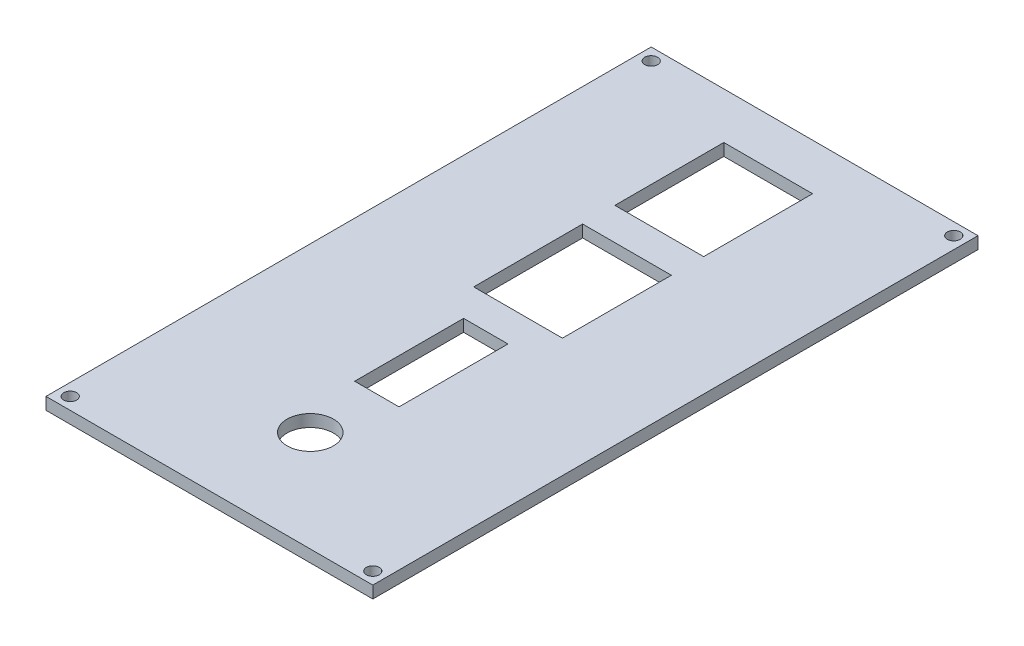
ISO-10303-21;
HEADER;
FILE_DESCRIPTION(('STEP AP214'),'2;1');
FILE_NAME('part.step','',(''),(''),'','','');
FILE_SCHEMA(('AUTOMOTIVE_DESIGN { 1 0 10303 214 1 1 1 1 }'));
ENDSEC;
DATA;
#1=APPLICATION_CONTEXT('core data for automotive mechanical design processes');
#2=APPLICATION_PROTOCOL_DEFINITION('international standard','automotive_design',2000,#1);
#3=PRODUCT_CONTEXT('',#1,'mechanical');
#4=PRODUCT('Part','Part','',(#3));
#5=PRODUCT_RELATED_PRODUCT_CATEGORY('part','',(#4));
#6=PRODUCT_DEFINITION_FORMATION('','',#4);
#7=PRODUCT_DEFINITION_CONTEXT('part definition',#1,'design');
#8=PRODUCT_DEFINITION('design','',#6,#7);
#9=PRODUCT_DEFINITION_SHAPE('','',#8);
#10=(LENGTH_UNIT() NAMED_UNIT(*) SI_UNIT(.MILLI.,.METRE.));
#11=(NAMED_UNIT(*) PLANE_ANGLE_UNIT() SI_UNIT($,.RADIAN.));
#12=(NAMED_UNIT(*) SI_UNIT($,.STERADIAN.) SOLID_ANGLE_UNIT());
#13=UNCERTAINTY_MEASURE_WITH_UNIT(LENGTH_MEASURE(1.E-05),#10,'distance_accuracy_value','');
#14=(GEOMETRIC_REPRESENTATION_CONTEXT(3) GLOBAL_UNCERTAINTY_ASSIGNED_CONTEXT((#13)) GLOBAL_UNIT_ASSIGNED_CONTEXT((#10,
#11,#12)) REPRESENTATION_CONTEXT('',''));
#15=CARTESIAN_POINT('',(0.,0.,0.));
#16=DIRECTION('',(0.,0.,1.));
#17=DIRECTION('',(1.,0.,0.));
#18=AXIS2_PLACEMENT_3D('',#15,#16,#17);
#19=CARTESIAN_POINT('',(0.,3.,0.));
#20=DIRECTION('',(1.,0.,0.));
#21=DIRECTION('',(0.,0.,-1.));
#22=AXIS2_PLACEMENT_3D('',#19,#20,#21);
#23=PLANE('',#22);
#24=DIRECTION('',(0.,0.,1.));
#25=VECTOR('',#24,1.);
#26=CARTESIAN_POINT('',(0.,0.,0.));
#27=LINE('',#26,#25);
#28=CARTESIAN_POINT('',(0.,0.,-150.));
#29=VERTEX_POINT('',#28);
#30=CARTESIAN_POINT('',(0.,0.,0.));
#31=VERTEX_POINT('',#30);
#32=EDGE_CURVE('E328',#29,#31,#27,.T.);
#33=ORIENTED_EDGE('',*,*,#32,.T.);
#34=DIRECTION('',(0.,-1.,0.));
#35=VECTOR('',#34,1.);
#36=CARTESIAN_POINT('',(0.,3.,0.));
#37=LINE('',#36,#35);
#38=CARTESIAN_POINT('',(0.,3.,0.));
#39=VERTEX_POINT('',#38);
#40=EDGE_CURVE('E11',#39,#31,#37,.T.);
#41=ORIENTED_EDGE('',*,*,#40,.F.);
#42=DIRECTION('',(0.,0.,1.));
#43=VECTOR('',#42,1.);
#44=CARTESIAN_POINT('',(0.,3.,0.));
#45=LINE('',#44,#43);
#46=CARTESIAN_POINT('',(0.,3.,-150.));
#47=VERTEX_POINT('',#46);
#48=EDGE_CURVE('E329',#47,#39,#45,.T.);
#49=ORIENTED_EDGE('',*,*,#48,.F.);
#50=DIRECTION('',(0.,-1.,0.));
#51=VECTOR('',#50,1.);
#52=CARTESIAN_POINT('',(0.,3.,-150.));
#53=LINE('',#52,#51);
#54=EDGE_CURVE('E343',#47,#29,#53,.T.);
#55=ORIENTED_EDGE('',*,*,#54,.T.);
#56=EDGE_LOOP('',(#33,#41,#49,#55));
#57=FACE_BOUND('',#56,.T.);
#58=ADVANCED_FACE('F38',(#57),#23,.F.);
#59=CARTESIAN_POINT('',(0.,3.,0.));
#60=DIRECTION('',(0.,0.,-1.));
#61=DIRECTION('',(-1.,0.,0.));
#62=AXIS2_PLACEMENT_3D('',#59,#60,#61);
#63=PLANE('',#62);
#64=DIRECTION('',(1.,0.,0.));
#65=VECTOR('',#64,1.);
#66=CARTESIAN_POINT('',(0.,0.,0.));
#67=LINE('',#66,#65);
#68=CARTESIAN_POINT('',(81.,0.,0.));
#69=VERTEX_POINT('',#68);
#70=EDGE_CURVE('E347',#31,#69,#67,.T.);
#71=ORIENTED_EDGE('',*,*,#70,.T.);
#72=DIRECTION('',(0.,-1.,0.));
#73=VECTOR('',#72,1.);
#74=CARTESIAN_POINT('',(81.,3.,0.));
#75=LINE('',#74,#73);
#76=CARTESIAN_POINT('',(81.,3.,0.));
#77=VERTEX_POINT('',#76);
#78=EDGE_CURVE('E46',#77,#69,#75,.T.);
#79=ORIENTED_EDGE('',*,*,#78,.F.);
#80=DIRECTION('',(1.,0.,0.));
#81=VECTOR('',#80,1.);
#82=CARTESIAN_POINT('',(0.,3.,0.));
#83=LINE('',#82,#81);
#84=EDGE_CURVE('E333',#39,#77,#83,.T.);
#85=ORIENTED_EDGE('',*,*,#84,.F.);
#86=ORIENTED_EDGE('',*,*,#40,.T.);
#87=EDGE_LOOP('',(#71,#79,#85,#86));
#88=FACE_BOUND('',#87,.T.);
#89=ADVANCED_FACE('F382',(#88),#63,.F.);
#90=CARTESIAN_POINT('',(81.,3.,0.));
#91=DIRECTION('',(-1.,0.,0.));
#92=DIRECTION('',(0.,0.,1.));
#93=AXIS2_PLACEMENT_3D('',#90,#91,#92);
#94=PLANE('',#93);
#95=DIRECTION('',(0.,0.,-1.));
#96=VECTOR('',#95,1.);
#97=CARTESIAN_POINT('',(81.,0.,0.));
#98=LINE('',#97,#96);
#99=CARTESIAN_POINT('',(81.,0.,-150.));
#100=VERTEX_POINT('',#99);
#101=EDGE_CURVE('E350',#69,#100,#98,.T.);
#102=ORIENTED_EDGE('',*,*,#101,.T.);
#103=DIRECTION('',(0.,-1.,0.));
#104=VECTOR('',#103,1.);
#105=CARTESIAN_POINT('',(81.,3.,-150.));
#106=LINE('',#105,#104);
#107=CARTESIAN_POINT('',(81.,3.,-150.));
#108=VERTEX_POINT('',#107);
#109=EDGE_CURVE('E358',#108,#100,#106,.T.);
#110=ORIENTED_EDGE('',*,*,#109,.F.);
#111=DIRECTION('',(0.,0.,-1.));
#112=VECTOR('',#111,1.);
#113=CARTESIAN_POINT('',(81.,3.,0.));
#114=LINE('',#113,#112);
#115=EDGE_CURVE('E337',#77,#108,#114,.T.);
#116=ORIENTED_EDGE('',*,*,#115,.F.);
#117=ORIENTED_EDGE('',*,*,#78,.T.);
#118=EDGE_LOOP('',(#102,#110,#116,#117));
#119=FACE_BOUND('',#118,.T.);
#120=ADVANCED_FACE('F367',(#119),#94,.F.);
#121=CARTESIAN_POINT('',(0.,3.,-150.));
#122=DIRECTION('',(0.,0.,1.));
#123=DIRECTION('',(1.,0.,0.));
#124=AXIS2_PLACEMENT_3D('',#121,#122,#123);
#125=PLANE('',#124);
#126=DIRECTION('',(-1.,0.,0.));
#127=VECTOR('',#126,1.);
#128=CARTESIAN_POINT('',(0.,0.,-150.));
#129=LINE('',#128,#127);
#130=EDGE_CURVE('E334',#100,#29,#129,.T.);
#131=ORIENTED_EDGE('',*,*,#130,.T.);
#132=ORIENTED_EDGE('',*,*,#54,.F.);
#133=DIRECTION('',(-1.,0.,0.));
#134=VECTOR('',#133,1.);
#135=CARTESIAN_POINT('',(0.,3.,-150.));
#136=LINE('',#135,#134);
#137=EDGE_CURVE('E340',#108,#47,#136,.T.);
#138=ORIENTED_EDGE('',*,*,#137,.F.);
#139=ORIENTED_EDGE('',*,*,#109,.T.);
#140=EDGE_LOOP('',(#131,#132,#138,#139));
#141=FACE_BOUND('',#140,.T.);
#142=ADVANCED_FACE('F375',(#141),#125,.F.);
#143=CARTESIAN_POINT('',(0.,3.,0.));
#144=DIRECTION('',(0.,-1.,0.));
#145=DIRECTION('',(0.,0.,-1.));
#146=AXIS2_PLACEMENT_3D('',#143,#144,#145);
#147=PLANE('',#146);
#148=DIRECTION('',(-1.,0.,0.));
#149=VECTOR('',#148,1.);
#150=CARTESIAN_POINT('',(29.5,3.,-138.5));
#151=LINE('',#150,#149);
#152=CARTESIAN_POINT('',(51.5,3.,-138.5));
#153=VERTEX_POINT('',#152);
#154=CARTESIAN_POINT('',(29.5,3.,-138.5));
#155=VERTEX_POINT('',#154);
#156=EDGE_CURVE('E188',#153,#155,#151,.T.);
#157=ORIENTED_EDGE('',*,*,#156,.F.);
#158=DIRECTION('',(0.,0.,-1.));
#159=VECTOR('',#158,1.);
#160=CARTESIAN_POINT('',(51.5,3.,-138.5));
#161=LINE('',#160,#159);
#162=CARTESIAN_POINT('',(51.5,3.,-111.5));
#163=VERTEX_POINT('',#162);
#164=EDGE_CURVE('E53',#163,#153,#161,.T.);
#165=ORIENTED_EDGE('',*,*,#164,.F.);
#166=DIRECTION('',(1.,0.,0.));
#167=VECTOR('',#166,1.);
#168=CARTESIAN_POINT('',(29.5,3.,-111.5));
#169=LINE('',#168,#167);
#170=CARTESIAN_POINT('',(29.5,3.,-111.5));
#171=VERTEX_POINT('',#170);
#172=EDGE_CURVE('E175',#171,#163,#169,.T.);
#173=ORIENTED_EDGE('',*,*,#172,.F.);
#174=DIRECTION('',(0.,0.,1.));
#175=VECTOR('',#174,1.);
#176=CARTESIAN_POINT('',(29.5,3.,-138.5));
#177=LINE('',#176,#175);
#178=EDGE_CURVE('E179',#155,#171,#177,.T.);
#179=ORIENTED_EDGE('',*,*,#178,.F.);
#180=EDGE_LOOP('',(#157,#165,#173,#179));
#181=FACE_BOUND('',#180,.T.);
#182=DIRECTION('',(-1.,0.,0.));
#183=VECTOR('',#182,1.);
#184=CARTESIAN_POINT('',(29.5,3.,-103.5));
#185=LINE('',#184,#183);
#186=CARTESIAN_POINT('',(51.5,3.,-103.5));
#187=VERTEX_POINT('',#186);
#188=CARTESIAN_POINT('',(29.5,3.,-103.5));
#189=VERTEX_POINT('',#188);
#190=EDGE_CURVE('E224',#187,#189,#185,.T.);
#191=ORIENTED_EDGE('',*,*,#190,.F.);
#192=DIRECTION('',(0.,0.,-1.));
#193=VECTOR('',#192,1.);
#194=CARTESIAN_POINT('',(51.5,3.,-103.5));
#195=LINE('',#194,#193);
#196=CARTESIAN_POINT('',(51.5,3.,-76.5));
#197=VERTEX_POINT('',#196);
#198=EDGE_CURVE('E61',#197,#187,#195,.T.);
#199=ORIENTED_EDGE('',*,*,#198,.F.);
#200=DIRECTION('',(1.,0.,0.));
#201=VECTOR('',#200,1.);
#202=CARTESIAN_POINT('',(29.5,3.,-76.5));
#203=LINE('',#202,#201);
#204=CARTESIAN_POINT('',(29.5,3.,-76.5));
#205=VERTEX_POINT('',#204);
#206=EDGE_CURVE('E209',#205,#197,#203,.T.);
#207=ORIENTED_EDGE('',*,*,#206,.F.);
#208=DIRECTION('',(0.,0.,1.));
#209=VECTOR('',#208,1.);
#210=CARTESIAN_POINT('',(29.5,3.,-103.5));
#211=LINE('',#210,#209);
#212=EDGE_CURVE('E229',#189,#205,#211,.T.);
#213=ORIENTED_EDGE('',*,*,#212,.F.);
#214=EDGE_LOOP('',(#191,#199,#207,#213));
#215=FACE_BOUND('',#214,.T.);
#216=DIRECTION('',(-1.,0.,0.));
#217=VECTOR('',#216,1.);
#218=CARTESIAN_POINT('',(35.,3.,-68.5));
#219=LINE('',#218,#217);
#220=CARTESIAN_POINT('',(46.,3.,-68.5));
#221=VERTEX_POINT('',#220);
#222=CARTESIAN_POINT('',(35.,3.,-68.5));
#223=VERTEX_POINT('',#222);
#224=EDGE_CURVE('E267',#221,#223,#219,.T.);
#225=ORIENTED_EDGE('',*,*,#224,.F.);
#226=DIRECTION('',(0.,0.,-1.));
#227=VECTOR('',#226,1.);
#228=CARTESIAN_POINT('',(46.,3.,-68.5));
#229=LINE('',#228,#227);
#230=CARTESIAN_POINT('',(46.,3.,-41.5));
#231=VERTEX_POINT('',#230);
#232=EDGE_CURVE('E264',#231,#221,#229,.T.);
#233=ORIENTED_EDGE('',*,*,#232,.F.);
#234=DIRECTION('',(1.,0.,0.));
#235=VECTOR('',#234,1.);
#236=CARTESIAN_POINT('',(35.,3.,-41.5));
#237=LINE('',#236,#235);
#238=CARTESIAN_POINT('',(35.,3.,-41.5));
#239=VERTEX_POINT('',#238);
#240=EDGE_CURVE('E251',#239,#231,#237,.T.);
#241=ORIENTED_EDGE('',*,*,#240,.F.);
#242=DIRECTION('',(0.,0.,1.));
#243=VECTOR('',#242,1.);
#244=CARTESIAN_POINT('',(35.,3.,-68.5));
#245=LINE('',#244,#243);
#246=EDGE_CURVE('E272',#223,#239,#245,.T.);
#247=ORIENTED_EDGE('',*,*,#246,.F.);
#248=EDGE_LOOP('',(#225,#233,#241,#247));
#249=FACE_BOUND('',#248,.T.);
#250=CARTESIAN_POINT('',(40.5,3.,-25.));
#251=DIRECTION('',(0.,1.,0.));
#252=DIRECTION('',(0.,0.,1.));
#253=AXIS2_PLACEMENT_3D('',#250,#251,#252);
#254=CIRCLE('',#253,5.75);
#255=CARTESIAN_POINT('',(40.5,3.,-19.25));
#256=VERTEX_POINT('',#255);
#257=EDGE_CURVE('E293',#256,#256,#254,.T.);
#258=ORIENTED_EDGE('',*,*,#257,.F.);
#259=EDGE_LOOP('',(#258));
#260=FACE_BOUND('',#259,.T.);
#261=CARTESIAN_POINT('',(3.,3.,-147.));
#262=DIRECTION('',(0.,1.,0.));
#263=DIRECTION('',(0.,0.,1.));
#264=AXIS2_PLACEMENT_3D('',#261,#262,#263);
#265=CIRCLE('',#264,1.6);
#266=CARTESIAN_POINT('',(3.,3.,-145.4));
#267=VERTEX_POINT('',#266);
#268=EDGE_CURVE('E198',#267,#267,#265,.T.);
#269=ORIENTED_EDGE('',*,*,#268,.F.);
#270=EDGE_LOOP('',(#269));
#271=FACE_BOUND('',#270,.T.);
#272=CARTESIAN_POINT('',(78.,3.,-147.));
#273=DIRECTION('',(0.,1.,0.));
#274=DIRECTION('',(0.,0.,1.));
#275=AXIS2_PLACEMENT_3D('',#272,#273,#274);
#276=CIRCLE('',#275,1.6);
#277=CARTESIAN_POINT('',(78.,3.,-145.4));
#278=VERTEX_POINT('',#277);
#279=EDGE_CURVE('E304',#278,#278,#276,.T.);
#280=ORIENTED_EDGE('',*,*,#279,.F.);
#281=EDGE_LOOP('',(#280));
#282=FACE_BOUND('',#281,.T.);
#283=CARTESIAN_POINT('',(78.,3.,-3.));
#284=DIRECTION('',(0.,1.,0.));
#285=DIRECTION('',(0.,0.,1.));
#286=AXIS2_PLACEMENT_3D('',#283,#284,#285);
#287=CIRCLE('',#286,1.6);
#288=CARTESIAN_POINT('',(78.,3.,-1.4));
#289=VERTEX_POINT('',#288);
#290=EDGE_CURVE('E312',#289,#289,#287,.T.);
#291=ORIENTED_EDGE('',*,*,#290,.F.);
#292=EDGE_LOOP('',(#291));
#293=FACE_BOUND('',#292,.T.);
#294=CARTESIAN_POINT('',(3.,3.,-3.));
#295=DIRECTION('',(0.,1.,0.));
#296=DIRECTION('',(0.,0.,1.));
#297=AXIS2_PLACEMENT_3D('',#294,#295,#296);
#298=CIRCLE('',#297,1.6);
#299=CARTESIAN_POINT('',(3.,3.,-1.4));
#300=VERTEX_POINT('',#299);
#301=EDGE_CURVE('E320',#300,#300,#298,.T.);
#302=ORIENTED_EDGE('',*,*,#301,.F.);
#303=EDGE_LOOP('',(#302));
#304=FACE_BOUND('',#303,.T.);
#305=ORIENTED_EDGE('',*,*,#48,.T.);
#306=ORIENTED_EDGE('',*,*,#84,.T.);
#307=ORIENTED_EDGE('',*,*,#115,.T.);
#308=ORIENTED_EDGE('',*,*,#137,.T.);
#309=EDGE_LOOP('',(#305,#306,#307,#308));
#310=FACE_BOUND('',#309,.T.);
#311=ADVANCED_FACE('F381',(#181,#215,#249,#260,#271,#282,#293,#304,#310),#147,.F.);
#312=CARTESIAN_POINT('',(0.,0.,0.));
#313=DIRECTION('',(0.,-1.,0.));
#314=DIRECTION('',(0.,0.,-1.));
#315=AXIS2_PLACEMENT_3D('',#312,#313,#314);
#316=PLANE('',#315);
#317=DIRECTION('',(0.,0.,-1.));
#318=VECTOR('',#317,1.);
#319=CARTESIAN_POINT('',(51.5,0.,-138.5));
#320=LINE('',#319,#318);
#321=CARTESIAN_POINT('',(51.5,0.,-111.5));
#322=VERTEX_POINT('',#321);
#323=CARTESIAN_POINT('',(51.5,0.,-138.5));
#324=VERTEX_POINT('',#323);
#325=EDGE_CURVE('E153',#322,#324,#320,.T.);
#326=ORIENTED_EDGE('',*,*,#325,.T.);
#327=DIRECTION('',(-1.,0.,0.));
#328=VECTOR('',#327,1.);
#329=CARTESIAN_POINT('',(29.5,0.,-138.5));
#330=LINE('',#329,#328);
#331=CARTESIAN_POINT('',(29.5,0.,-138.5));
#332=VERTEX_POINT('',#331);
#333=EDGE_CURVE('E164',#324,#332,#330,.T.);
#334=ORIENTED_EDGE('',*,*,#333,.T.);
#335=DIRECTION('',(0.,0.,1.));
#336=VECTOR('',#335,1.);
#337=CARTESIAN_POINT('',(29.5,0.,-138.5));
#338=LINE('',#337,#336);
#339=CARTESIAN_POINT('',(29.5,0.,-111.5));
#340=VERTEX_POINT('',#339);
#341=EDGE_CURVE('E169',#332,#340,#338,.T.);
#342=ORIENTED_EDGE('',*,*,#341,.T.);
#343=DIRECTION('',(1.,0.,0.));
#344=VECTOR('',#343,1.);
#345=CARTESIAN_POINT('',(29.5,0.,-111.5));
#346=LINE('',#345,#344);
#347=EDGE_CURVE('E160',#340,#322,#346,.T.);
#348=ORIENTED_EDGE('',*,*,#347,.T.);
#349=EDGE_LOOP('',(#326,#334,#342,#348));
#350=FACE_BOUND('',#349,.T.);
#351=DIRECTION('',(0.,0.,-1.));
#352=VECTOR('',#351,1.);
#353=CARTESIAN_POINT('',(51.5,0.,-103.5));
#354=LINE('',#353,#352);
#355=CARTESIAN_POINT('',(51.5,0.,-76.5));
#356=VERTEX_POINT('',#355);
#357=CARTESIAN_POINT('',(51.5,0.,-103.5));
#358=VERTEX_POINT('',#357);
#359=EDGE_CURVE('E204',#356,#358,#354,.T.);
#360=ORIENTED_EDGE('',*,*,#359,.T.);
#361=DIRECTION('',(-1.,0.,0.));
#362=VECTOR('',#361,1.);
#363=CARTESIAN_POINT('',(29.5,0.,-103.5));
#364=LINE('',#363,#362);
#365=CARTESIAN_POINT('',(29.5,0.,-103.5));
#366=VERTEX_POINT('',#365);
#367=EDGE_CURVE('E208',#358,#366,#364,.T.);
#368=ORIENTED_EDGE('',*,*,#367,.T.);
#369=DIRECTION('',(0.,0.,1.));
#370=VECTOR('',#369,1.);
#371=CARTESIAN_POINT('',(29.5,0.,-103.5));
#372=LINE('',#371,#370);
#373=CARTESIAN_POINT('',(29.5,0.,-76.5));
#374=VERTEX_POINT('',#373);
#375=EDGE_CURVE('E213',#366,#374,#372,.T.);
#376=ORIENTED_EDGE('',*,*,#375,.T.);
#377=DIRECTION('',(1.,0.,0.));
#378=VECTOR('',#377,1.);
#379=CARTESIAN_POINT('',(29.5,0.,-76.5));
#380=LINE('',#379,#378);
#381=EDGE_CURVE('E217',#374,#356,#380,.T.);
#382=ORIENTED_EDGE('',*,*,#381,.T.);
#383=EDGE_LOOP('',(#360,#368,#376,#382));
#384=FACE_BOUND('',#383,.T.);
#385=DIRECTION('',(0.,0.,-1.));
#386=VECTOR('',#385,1.);
#387=CARTESIAN_POINT('',(46.,0.,-68.5));
#388=LINE('',#387,#386);
#389=CARTESIAN_POINT('',(46.,0.,-41.5));
#390=VERTEX_POINT('',#389);
#391=CARTESIAN_POINT('',(46.,0.,-68.5));
#392=VERTEX_POINT('',#391);
#393=EDGE_CURVE('E246',#390,#392,#388,.T.);
#394=ORIENTED_EDGE('',*,*,#393,.T.);
#395=DIRECTION('',(-1.,0.,0.));
#396=VECTOR('',#395,1.);
#397=CARTESIAN_POINT('',(35.,0.,-68.5));
#398=LINE('',#397,#396);
#399=CARTESIAN_POINT('',(35.,0.,-68.5));
#400=VERTEX_POINT('',#399);
#401=EDGE_CURVE('E250',#392,#400,#398,.T.);
#402=ORIENTED_EDGE('',*,*,#401,.T.);
#403=DIRECTION('',(0.,0.,1.));
#404=VECTOR('',#403,1.);
#405=CARTESIAN_POINT('',(35.,0.,-68.5));
#406=LINE('',#405,#404);
#407=CARTESIAN_POINT('',(35.,0.,-41.5));
#408=VERTEX_POINT('',#407);
#409=EDGE_CURVE('E255',#400,#408,#406,.T.);
#410=ORIENTED_EDGE('',*,*,#409,.T.);
#411=DIRECTION('',(1.,0.,0.));
#412=VECTOR('',#411,1.);
#413=CARTESIAN_POINT('',(35.,0.,-41.5));
#414=LINE('',#413,#412);
#415=EDGE_CURVE('E259',#408,#390,#414,.T.);
#416=ORIENTED_EDGE('',*,*,#415,.T.);
#417=EDGE_LOOP('',(#394,#402,#410,#416));
#418=FACE_BOUND('',#417,.T.);
#419=CARTESIAN_POINT('',(40.5,0.,-25.));
#420=DIRECTION('',(0.,1.,0.));
#421=DIRECTION('',(0.,0.,1.));
#422=AXIS2_PLACEMENT_3D('',#419,#420,#421);
#423=CIRCLE('',#422,5.75);
#424=CARTESIAN_POINT('',(40.5,0.,-19.25));
#425=VERTEX_POINT('',#424);
#426=EDGE_CURVE('E268',#425,#425,#423,.T.);
#427=ORIENTED_EDGE('',*,*,#426,.T.);
#428=EDGE_LOOP('',(#427));
#429=FACE_BOUND('',#428,.T.);
#430=CARTESIAN_POINT('',(3.,0.,-147.));
#431=DIRECTION('',(0.,1.,0.));
#432=DIRECTION('',(0.,0.,1.));
#433=AXIS2_PLACEMENT_3D('',#430,#431,#432);
#434=CIRCLE('',#433,1.6);
#435=CARTESIAN_POINT('',(3.,0.,-145.4));
#436=VERTEX_POINT('',#435);
#437=EDGE_CURVE('E300',#436,#436,#434,.T.);
#438=ORIENTED_EDGE('',*,*,#437,.T.);
#439=EDGE_LOOP('',(#438));
#440=FACE_BOUND('',#439,.T.);
#441=CARTESIAN_POINT('',(78.,0.,-147.));
#442=DIRECTION('',(0.,1.,0.));
#443=DIRECTION('',(0.,0.,1.));
#444=AXIS2_PLACEMENT_3D('',#441,#442,#443);
#445=CIRCLE('',#444,1.6);
#446=CARTESIAN_POINT('',(78.,0.,-145.4));
#447=VERTEX_POINT('',#446);
#448=EDGE_CURVE('E308',#447,#447,#445,.T.);
#449=ORIENTED_EDGE('',*,*,#448,.T.);
#450=EDGE_LOOP('',(#449));
#451=FACE_BOUND('',#450,.T.);
#452=CARTESIAN_POINT('',(78.,0.,-3.));
#453=DIRECTION('',(0.,1.,0.));
#454=DIRECTION('',(0.,0.,1.));
#455=AXIS2_PLACEMENT_3D('',#452,#453,#454);
#456=CIRCLE('',#455,1.6);
#457=CARTESIAN_POINT('',(78.,0.,-1.4));
#458=VERTEX_POINT('',#457);
#459=EDGE_CURVE('E316',#458,#458,#456,.T.);
#460=ORIENTED_EDGE('',*,*,#459,.T.);
#461=EDGE_LOOP('',(#460));
#462=FACE_BOUND('',#461,.T.);
#463=CARTESIAN_POINT('',(3.,0.,-3.));
#464=DIRECTION('',(0.,1.,0.));
#465=DIRECTION('',(0.,0.,1.));
#466=AXIS2_PLACEMENT_3D('',#463,#464,#465);
#467=CIRCLE('',#466,1.6);
#468=CARTESIAN_POINT('',(3.,0.,-1.4));
#469=VERTEX_POINT('',#468);
#470=EDGE_CURVE('E324',#469,#469,#467,.T.);
#471=ORIENTED_EDGE('',*,*,#470,.T.);
#472=EDGE_LOOP('',(#471));
#473=FACE_BOUND('',#472,.T.);
#474=ORIENTED_EDGE('',*,*,#32,.F.);
#475=ORIENTED_EDGE('',*,*,#130,.F.);
#476=ORIENTED_EDGE('',*,*,#101,.F.);
#477=ORIENTED_EDGE('',*,*,#70,.F.);
#478=EDGE_LOOP('',(#474,#475,#476,#477));
#479=FACE_BOUND('',#478,.T.);
#480=ADVANCED_FACE('F171',(#350,#384,#418,#429,#440,#451,#462,#473,#479),#316,.T.);
#481=CARTESIAN_POINT('',(3.,3.,-3.));
#482=DIRECTION('',(0.,1.,0.));
#483=DIRECTION('',(0.,0.,1.));
#484=AXIS2_PLACEMENT_3D('',#481,#482,#483);
#485=CYLINDRICAL_SURFACE('',#484,1.6);
#486=ORIENTED_EDGE('',*,*,#470,.F.);
#487=EDGE_LOOP('',(#486));
#488=FACE_BOUND('',#487,.T.);
#489=ORIENTED_EDGE('',*,*,#301,.T.);
#490=EDGE_LOOP('',(#489));
#491=FACE_BOUND('',#490,.T.);
#492=ADVANCED_FACE('F394',(#488,#491),#485,.F.);
#493=CARTESIAN_POINT('',(78.,3.,-3.));
#494=DIRECTION('',(0.,1.,0.));
#495=DIRECTION('',(0.,0.,1.));
#496=AXIS2_PLACEMENT_3D('',#493,#494,#495);
#497=CYLINDRICAL_SURFACE('',#496,1.6);
#498=ORIENTED_EDGE('',*,*,#459,.F.);
#499=EDGE_LOOP('',(#498));
#500=FACE_BOUND('',#499,.T.);
#501=ORIENTED_EDGE('',*,*,#290,.T.);
#502=EDGE_LOOP('',(#501));
#503=FACE_BOUND('',#502,.T.);
#504=ADVANCED_FACE('F400',(#500,#503),#497,.F.);
#505=CARTESIAN_POINT('',(78.,3.,-147.));
#506=DIRECTION('',(0.,1.,0.));
#507=DIRECTION('',(0.,0.,1.));
#508=AXIS2_PLACEMENT_3D('',#505,#506,#507);
#509=CYLINDRICAL_SURFACE('',#508,1.6);
#510=ORIENTED_EDGE('',*,*,#448,.F.);
#511=EDGE_LOOP('',(#510));
#512=FACE_BOUND('',#511,.T.);
#513=ORIENTED_EDGE('',*,*,#279,.T.);
#514=EDGE_LOOP('',(#513));
#515=FACE_BOUND('',#514,.T.);
#516=ADVANCED_FACE('F404',(#512,#515),#509,.F.);
#517=CARTESIAN_POINT('',(3.,3.,-147.));
#518=DIRECTION('',(0.,1.,0.));
#519=DIRECTION('',(0.,0.,1.));
#520=AXIS2_PLACEMENT_3D('',#517,#518,#519);
#521=CYLINDRICAL_SURFACE('',#520,1.6);
#522=ORIENTED_EDGE('',*,*,#437,.F.);
#523=EDGE_LOOP('',(#522));
#524=FACE_BOUND('',#523,.T.);
#525=ORIENTED_EDGE('',*,*,#268,.T.);
#526=EDGE_LOOP('',(#525));
#527=FACE_BOUND('',#526,.T.);
#528=ADVANCED_FACE('F408',(#524,#527),#521,.F.);
#529=CARTESIAN_POINT('',(40.5,0.,-25.));
#530=DIRECTION('',(0.,1.,0.));
#531=DIRECTION('',(0.,0.,1.));
#532=AXIS2_PLACEMENT_3D('',#529,#530,#531);
#533=CYLINDRICAL_SURFACE('',#532,5.75);
#534=ORIENTED_EDGE('',*,*,#426,.F.);
#535=EDGE_LOOP('',(#534));
#536=FACE_BOUND('',#535,.T.);
#537=ORIENTED_EDGE('',*,*,#257,.T.);
#538=EDGE_LOOP('',(#537));
#539=FACE_BOUND('',#538,.T.);
#540=ADVANCED_FACE('F412',(#536,#539),#533,.F.);
#541=CARTESIAN_POINT('',(46.,0.,-68.5));
#542=DIRECTION('',(1.,0.,0.));
#543=DIRECTION('',(0.,0.,-1.));
#544=AXIS2_PLACEMENT_3D('',#541,#542,#543);
#545=PLANE('',#544);
#546=ORIENTED_EDGE('',*,*,#232,.T.);
#547=DIRECTION('',(0.,1.,0.));
#548=VECTOR('',#547,1.);
#549=CARTESIAN_POINT('',(46.,0.,-68.5));
#550=LINE('',#549,#548);
#551=EDGE_CURVE('E263',#392,#221,#550,.T.);
#552=ORIENTED_EDGE('',*,*,#551,.F.);
#553=ORIENTED_EDGE('',*,*,#393,.F.);
#554=DIRECTION('',(0.,1.,0.));
#555=VECTOR('',#554,1.);
#556=CARTESIAN_POINT('',(46.,0.,-41.5));
#557=LINE('',#556,#555);
#558=EDGE_CURVE('E225',#390,#231,#557,.T.);
#559=ORIENTED_EDGE('',*,*,#558,.T.);
#560=EDGE_LOOP('',(#546,#552,#553,#559));
#561=FACE_BOUND('',#560,.T.);
#562=ADVANCED_FACE('F416',(#561),#545,.F.);
#563=CARTESIAN_POINT('',(35.,0.,-41.5));
#564=DIRECTION('',(0.,0.,1.));
#565=DIRECTION('',(1.,0.,0.));
#566=AXIS2_PLACEMENT_3D('',#563,#564,#565);
#567=PLANE('',#566);
#568=ORIENTED_EDGE('',*,*,#240,.T.);
#569=ORIENTED_EDGE('',*,*,#558,.F.);
#570=ORIENTED_EDGE('',*,*,#415,.F.);
#571=DIRECTION('',(0.,1.,0.));
#572=VECTOR('',#571,1.);
#573=CARTESIAN_POINT('',(35.,0.,-41.5));
#574=LINE('',#573,#572);
#575=EDGE_CURVE('E281',#408,#239,#574,.T.);
#576=ORIENTED_EDGE('',*,*,#575,.T.);
#577=EDGE_LOOP('',(#568,#569,#570,#576));
#578=FACE_BOUND('',#577,.T.);
#579=ADVANCED_FACE('F420',(#578),#567,.F.);
#580=CARTESIAN_POINT('',(35.,0.,-68.5));
#581=DIRECTION('',(-1.,0.,0.));
#582=DIRECTION('',(0.,0.,1.));
#583=AXIS2_PLACEMENT_3D('',#580,#581,#582);
#584=PLANE('',#583);
#585=ORIENTED_EDGE('',*,*,#246,.T.);
#586=ORIENTED_EDGE('',*,*,#575,.F.);
#587=ORIENTED_EDGE('',*,*,#409,.F.);
#588=DIRECTION('',(0.,1.,0.));
#589=VECTOR('',#588,1.);
#590=CARTESIAN_POINT('',(35.,0.,-68.5));
#591=LINE('',#590,#589);
#592=EDGE_CURVE('E284',#400,#223,#591,.T.);
#593=ORIENTED_EDGE('',*,*,#592,.T.);
#594=EDGE_LOOP('',(#585,#586,#587,#593));
#595=FACE_BOUND('',#594,.T.);
#596=ADVANCED_FACE('F426',(#595),#584,.F.);
#597=CARTESIAN_POINT('',(35.,0.,-68.5));
#598=DIRECTION('',(0.,0.,-1.));
#599=DIRECTION('',(-1.,0.,0.));
#600=AXIS2_PLACEMENT_3D('',#597,#598,#599);
#601=PLANE('',#600);
#602=ORIENTED_EDGE('',*,*,#224,.T.);
#603=ORIENTED_EDGE('',*,*,#592,.F.);
#604=ORIENTED_EDGE('',*,*,#401,.F.);
#605=ORIENTED_EDGE('',*,*,#551,.T.);
#606=EDGE_LOOP('',(#602,#603,#604,#605));
#607=FACE_BOUND('',#606,.T.);
#608=ADVANCED_FACE('F422',(#607),#601,.F.);
#609=CARTESIAN_POINT('',(51.5,0.,-103.5));
#610=DIRECTION('',(1.,0.,0.));
#611=DIRECTION('',(0.,0.,-1.));
#612=AXIS2_PLACEMENT_3D('',#609,#610,#611);
#613=PLANE('',#612);
#614=ORIENTED_EDGE('',*,*,#198,.T.);
#615=DIRECTION('',(0.,1.,0.));
#616=VECTOR('',#615,1.);
#617=CARTESIAN_POINT('',(51.5,0.,-103.5));
#618=LINE('',#617,#616);
#619=EDGE_CURVE('E221',#358,#187,#618,.T.);
#620=ORIENTED_EDGE('',*,*,#619,.F.);
#621=ORIENTED_EDGE('',*,*,#359,.F.);
#622=DIRECTION('',(0.,1.,0.));
#623=VECTOR('',#622,1.);
#624=CARTESIAN_POINT('',(51.5,0.,-76.5));
#625=LINE('',#624,#623);
#626=EDGE_CURVE('E189',#356,#197,#625,.T.);
#627=ORIENTED_EDGE('',*,*,#626,.T.);
#628=EDGE_LOOP('',(#614,#620,#621,#627));
#629=FACE_BOUND('',#628,.T.);
#630=ADVANCED_FACE('F425',(#629),#613,.F.);
#631=CARTESIAN_POINT('',(29.5,0.,-76.5));
#632=DIRECTION('',(0.,0.,1.));
#633=DIRECTION('',(1.,0.,0.));
#634=AXIS2_PLACEMENT_3D('',#631,#632,#633);
#635=PLANE('',#634);
#636=ORIENTED_EDGE('',*,*,#206,.T.);
#637=ORIENTED_EDGE('',*,*,#626,.F.);
#638=ORIENTED_EDGE('',*,*,#381,.F.);
#639=DIRECTION('',(0.,1.,0.));
#640=VECTOR('',#639,1.);
#641=CARTESIAN_POINT('',(29.5,0.,-76.5));
#642=LINE('',#641,#640);
#643=EDGE_CURVE('E238',#374,#205,#642,.T.);
#644=ORIENTED_EDGE('',*,*,#643,.T.);
#645=EDGE_LOOP('',(#636,#637,#638,#644));
#646=FACE_BOUND('',#645,.T.);
#647=ADVANCED_FACE('F436',(#646),#635,.F.);
#648=CARTESIAN_POINT('',(29.5,0.,-103.5));
#649=DIRECTION('',(-1.,0.,0.));
#650=DIRECTION('',(0.,0.,1.));
#651=AXIS2_PLACEMENT_3D('',#648,#649,#650);
#652=PLANE('',#651);
#653=ORIENTED_EDGE('',*,*,#212,.T.);
#654=ORIENTED_EDGE('',*,*,#643,.F.);
#655=ORIENTED_EDGE('',*,*,#375,.F.);
#656=DIRECTION('',(0.,1.,0.));
#657=VECTOR('',#656,1.);
#658=CARTESIAN_POINT('',(29.5,0.,-103.5));
#659=LINE('',#658,#657);
#660=EDGE_CURVE('E241',#366,#189,#659,.T.);
#661=ORIENTED_EDGE('',*,*,#660,.T.);
#662=EDGE_LOOP('',(#653,#654,#655,#661));
#663=FACE_BOUND('',#662,.T.);
#664=ADVANCED_FACE('F440',(#663),#652,.F.);
#665=CARTESIAN_POINT('',(29.5,0.,-103.5));
#666=DIRECTION('',(0.,0.,-1.));
#667=DIRECTION('',(-1.,0.,0.));
#668=AXIS2_PLACEMENT_3D('',#665,#666,#667);
#669=PLANE('',#668);
#670=ORIENTED_EDGE('',*,*,#190,.T.);
#671=ORIENTED_EDGE('',*,*,#660,.F.);
#672=ORIENTED_EDGE('',*,*,#367,.F.);
#673=ORIENTED_EDGE('',*,*,#619,.T.);
#674=EDGE_LOOP('',(#670,#671,#672,#673));
#675=FACE_BOUND('',#674,.T.);
#676=ADVANCED_FACE('F437',(#675),#669,.F.);
#677=CARTESIAN_POINT('',(51.5,0.,-138.5));
#678=DIRECTION('',(1.,0.,0.));
#679=DIRECTION('',(0.,0.,-1.));
#680=AXIS2_PLACEMENT_3D('',#677,#678,#679);
#681=PLANE('',#680);
#682=ORIENTED_EDGE('',*,*,#164,.T.);
#683=DIRECTION('',(0.,1.,0.));
#684=VECTOR('',#683,1.);
#685=CARTESIAN_POINT('',(51.5,0.,-138.5));
#686=LINE('',#685,#684);
#687=EDGE_CURVE('E149',#324,#153,#686,.T.);
#688=ORIENTED_EDGE('',*,*,#687,.F.);
#689=ORIENTED_EDGE('',*,*,#325,.F.);
#690=DIRECTION('',(0.,1.,0.));
#691=VECTOR('',#690,1.);
#692=CARTESIAN_POINT('',(51.5,0.,-111.5));
#693=LINE('',#692,#691);
#694=EDGE_CURVE('E195',#322,#163,#693,.T.);
#695=ORIENTED_EDGE('',*,*,#694,.T.);
#696=EDGE_LOOP('',(#682,#688,#689,#695));
#697=FACE_BOUND('',#696,.T.);
#698=ADVANCED_FACE('F151',(#697),#681,.F.);
#699=CARTESIAN_POINT('',(29.5,0.,-111.5));
#700=DIRECTION('',(0.,0.,1.));
#701=DIRECTION('',(1.,0.,0.));
#702=AXIS2_PLACEMENT_3D('',#699,#700,#701);
#703=PLANE('',#702);
#704=ORIENTED_EDGE('',*,*,#172,.T.);
#705=ORIENTED_EDGE('',*,*,#694,.F.);
#706=ORIENTED_EDGE('',*,*,#347,.F.);
#707=DIRECTION('',(0.,1.,0.));
#708=VECTOR('',#707,1.);
#709=CARTESIAN_POINT('',(29.5,0.,-111.5));
#710=LINE('',#709,#708);
#711=EDGE_CURVE('E199',#340,#171,#710,.T.);
#712=ORIENTED_EDGE('',*,*,#711,.T.);
#713=EDGE_LOOP('',(#704,#705,#706,#712));
#714=FACE_BOUND('',#713,.T.);
#715=ADVANCED_FACE('F450',(#714),#703,.F.);
#716=CARTESIAN_POINT('',(29.5,0.,-138.5));
#717=DIRECTION('',(-1.,0.,0.));
#718=DIRECTION('',(0.,0.,1.));
#719=AXIS2_PLACEMENT_3D('',#716,#717,#718);
#720=PLANE('',#719);
#721=ORIENTED_EDGE('',*,*,#178,.T.);
#722=ORIENTED_EDGE('',*,*,#711,.F.);
#723=ORIENTED_EDGE('',*,*,#341,.F.);
#724=DIRECTION('',(0.,1.,0.));
#725=VECTOR('',#724,1.);
#726=CARTESIAN_POINT('',(29.5,0.,-138.5));
#727=LINE('',#726,#725);
#728=EDGE_CURVE('E159',#332,#155,#727,.T.);
#729=ORIENTED_EDGE('',*,*,#728,.T.);
#730=EDGE_LOOP('',(#721,#722,#723,#729));
#731=FACE_BOUND('',#730,.T.);
#732=ADVANCED_FACE('F453',(#731),#720,.F.);
#733=CARTESIAN_POINT('',(29.5,0.,-138.5));
#734=DIRECTION('',(0.,0.,-1.));
#735=DIRECTION('',(-1.,0.,0.));
#736=AXIS2_PLACEMENT_3D('',#733,#734,#735);
#737=PLANE('',#736);
#738=ORIENTED_EDGE('',*,*,#156,.T.);
#739=ORIENTED_EDGE('',*,*,#728,.F.);
#740=ORIENTED_EDGE('',*,*,#333,.F.);
#741=ORIENTED_EDGE('',*,*,#687,.T.);
#742=EDGE_LOOP('',(#738,#739,#740,#741));
#743=FACE_BOUND('',#742,.T.);
#744=ADVANCED_FACE('F165',(#743),#737,.F.);
#745=CLOSED_SHELL('',(#58,#89,#120,#142,#311,#480,#492,#504,#516,#528,#540,#562,#579,#596,#608,
#630,#647,#664,#676,#698,#715,#732,#744));
#746=MANIFOLD_SOLID_BREP('B2',#745);
#747=ADVANCED_BREP_SHAPE_REPRESENTATION('',(#18,#746),#14);
#748=SHAPE_DEFINITION_REPRESENTATION(#9,#747);
ENDSEC;
END-ISO-10303-21;
